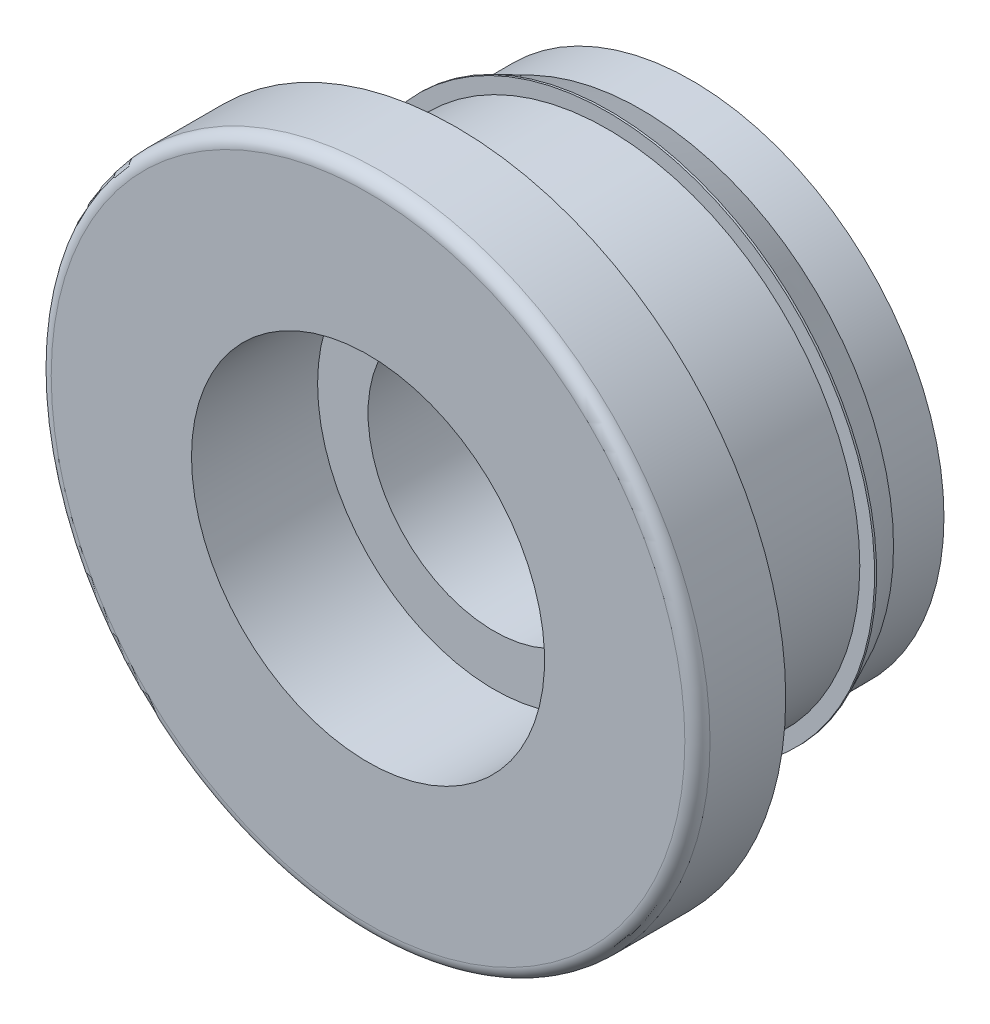
ISO-10303-21;
HEADER;
FILE_DESCRIPTION(('STEP AP214'),'2;1');
FILE_NAME('part.step','',(''),(''),'','','');
FILE_SCHEMA(('AUTOMOTIVE_DESIGN { 1 0 10303 214 1 1 1 1 }'));
ENDSEC;
DATA;
#1=APPLICATION_CONTEXT('core data for automotive mechanical design processes');
#2=APPLICATION_PROTOCOL_DEFINITION('international standard','automotive_design',2000,#1);
#3=PRODUCT_CONTEXT('',#1,'mechanical');
#4=PRODUCT('Part','Part','',(#3));
#5=PRODUCT_RELATED_PRODUCT_CATEGORY('part','',(#4));
#6=PRODUCT_DEFINITION_FORMATION('','',#4);
#7=PRODUCT_DEFINITION_CONTEXT('part definition',#1,'design');
#8=PRODUCT_DEFINITION('design','',#6,#7);
#9=PRODUCT_DEFINITION_SHAPE('','',#8);
#10=(LENGTH_UNIT() NAMED_UNIT(*) SI_UNIT(.MILLI.,.METRE.));
#11=(NAMED_UNIT(*) PLANE_ANGLE_UNIT() SI_UNIT($,.RADIAN.));
#12=(NAMED_UNIT(*) SI_UNIT($,.STERADIAN.) SOLID_ANGLE_UNIT());
#13=UNCERTAINTY_MEASURE_WITH_UNIT(LENGTH_MEASURE(1.E-05),#10,'distance_accuracy_value','');
#14=(GEOMETRIC_REPRESENTATION_CONTEXT(3) GLOBAL_UNCERTAINTY_ASSIGNED_CONTEXT((#13)) GLOBAL_UNIT_ASSIGNED_CONTEXT((#10,
#11,#12)) REPRESENTATION_CONTEXT('',''));
#15=CARTESIAN_POINT('',(0.,0.,0.));
#16=DIRECTION('',(0.,0.,1.));
#17=DIRECTION('',(1.,0.,0.));
#18=AXIS2_PLACEMENT_3D('',#15,#16,#17);
#19=CARTESIAN_POINT('',(0.,0.,4.1));
#20=DIRECTION('',(0.,0.,1.));
#21=DIRECTION('',(1.,0.,0.));
#22=AXIS2_PLACEMENT_3D('',#19,#20,#21);
#23=PLANE('',#22);
#24=CARTESIAN_POINT('',(0.,0.,4.1));
#25=DIRECTION('',(0.,0.,-1.));
#26=DIRECTION('',(-1.,0.,0.));
#27=AXIS2_PLACEMENT_3D('',#24,#25,#26);
#28=CIRCLE('',#27,4.);
#29=CARTESIAN_POINT('',(4.,0.,4.09999999999995));
#30=VERTEX_POINT('',#29);
#31=EDGE_CURVE('E25',#30,#30,#28,.T.);
#32=ORIENTED_EDGE('',*,*,#31,.F.);
#33=EDGE_LOOP('',(#32));
#34=FACE_BOUND('',#33,.T.);
#35=CARTESIAN_POINT('',(0.,0.,4.1));
#36=DIRECTION('',(0.,0.,1.));
#37=DIRECTION('',(1.,0.,0.));
#38=AXIS2_PLACEMENT_3D('',#35,#36,#37);
#39=CIRCLE('',#38,5.225);
#40=CARTESIAN_POINT('',(-5.225,0.,4.10000000000005));
#41=VERTEX_POINT('',#40);
#42=EDGE_CURVE('E130',#41,#41,#39,.T.);
#43=ORIENTED_EDGE('',*,*,#42,.F.);
#44=EDGE_LOOP('',(#43));
#45=FACE_BOUND('',#44,.T.);
#46=ADVANCED_FACE('F16',(#34,#45),#23,.F.);
#47=CARTESIAN_POINT('',(0.,0.,2.1));
#48=DIRECTION('',(0.,0.,-1.));
#49=DIRECTION('',(-1.,0.,0.));
#50=AXIS2_PLACEMENT_3D('',#47,#48,#49);
#51=CYLINDRICAL_SURFACE('',#50,2.);
#52=CARTESIAN_POINT('',(0.,0.,0.365));
#53=DIRECTION('',(0.,0.,1.));
#54=DIRECTION('',(-1.,0.,0.));
#55=AXIS2_PLACEMENT_3D('',#52,#53,#54);
#56=CIRCLE('',#55,2.);
#57=CARTESIAN_POINT('',(2.,0.,0.364999999999983));
#58=VERTEX_POINT('',#57);
#59=EDGE_CURVE('E121',#58,#58,#56,.T.);
#60=ORIENTED_EDGE('',*,*,#59,.F.);
#61=DIRECTION('',(0.,0.,1.));
#62=VECTOR('',#61,1.);
#63=CARTESIAN_POINT('',(2.,0.,2.1));
#64=LINE('',#63,#62);
#65=CARTESIAN_POINT('',(2.00000000000003,0.,3.5));
#66=VERTEX_POINT('',#65);
#67=EDGE_CURVE('E11',#58,#66,#64,.T.);
#68=ORIENTED_EDGE('',*,*,#67,.T.);
#69=CARTESIAN_POINT('',(0.,0.,3.5));
#70=DIRECTION('',(0.,0.,1.));
#71=DIRECTION('',(-1.,0.,0.));
#72=AXIS2_PLACEMENT_3D('',#69,#70,#71);
#73=CIRCLE('',#72,2.);
#74=EDGE_CURVE('E146',#66,#66,#73,.T.);
#75=ORIENTED_EDGE('',*,*,#74,.T.);
#76=ORIENTED_EDGE('',*,*,#67,.F.);
#77=EDGE_LOOP('',(#60,#68,#75,#76));
#78=FACE_BOUND('',#77,.T.);
#79=ADVANCED_FACE('F272',(#78),#51,.F.);
#80=CARTESIAN_POINT('',(0.,0.,4.5));
#81=DIRECTION('',(0.,0.,-1.));
#82=DIRECTION('',(-1.,0.,0.));
#83=AXIS2_PLACEMENT_3D('',#80,#81,#82);
#84=CYLINDRICAL_SURFACE('',#83,4.);
#85=CARTESIAN_POINT('',(0.,0.,1.7));
#86=DIRECTION('',(0.,0.,1.));
#87=DIRECTION('',(-1.,0.,0.));
#88=AXIS2_PLACEMENT_3D('',#85,#86,#87);
#89=CIRCLE('',#88,4.);
#90=CARTESIAN_POINT('',(4.,0.,1.69999999999994));
#91=VERTEX_POINT('',#90);
#92=EDGE_CURVE('E155',#91,#91,#89,.T.);
#93=ORIENTED_EDGE('',*,*,#92,.T.);
#94=DIRECTION('',(0.,0.,1.));
#95=VECTOR('',#94,1.);
#96=CARTESIAN_POINT('',(4.00000000000005,0.,4.49999999999995));
#97=LINE('',#96,#95);
#98=EDGE_CURVE('E145',#91,#30,#97,.T.);
#99=ORIENTED_EDGE('',*,*,#98,.T.);
#100=ORIENTED_EDGE('',*,*,#31,.T.);
#101=ORIENTED_EDGE('',*,*,#98,.F.);
#102=EDGE_LOOP('',(#93,#99,#100,#101));
#103=FACE_BOUND('',#102,.T.);
#104=ADVANCED_FACE('F263',(#103),#84,.T.);
#105=CARTESIAN_POINT('',(0.,0.,5.5));
#106=DIRECTION('',(0.,0.,1.));
#107=DIRECTION('',(1.,0.,0.));
#108=AXIS2_PLACEMENT_3D('',#105,#106,#107);
#109=CYLINDRICAL_SURFACE('',#108,2.8);
#110=CARTESIAN_POINT('',(0.,0.,3.5));
#111=DIRECTION('',(0.,0.,-1.));
#112=DIRECTION('',(1.,0.,0.));
#113=AXIS2_PLACEMENT_3D('',#110,#111,#112);
#114=CIRCLE('',#113,2.8);
#115=CARTESIAN_POINT('',(-2.8,0.,3.5));
#116=VERTEX_POINT('',#115);
#117=EDGE_CURVE('E165',#116,#116,#114,.T.);
#118=ORIENTED_EDGE('',*,*,#117,.T.);
#119=DIRECTION('',(0.,0.,1.));
#120=VECTOR('',#119,1.);
#121=CARTESIAN_POINT('',(-2.79999999999995,0.,5.5));
#122=LINE('',#121,#120);
#123=CARTESIAN_POINT('',(-2.79999999999995,0.,5.5));
#124=VERTEX_POINT('',#123);
#125=EDGE_CURVE('E142',#116,#124,#122,.T.);
#126=ORIENTED_EDGE('',*,*,#125,.T.);
#127=CARTESIAN_POINT('',(0.,0.,5.5));
#128=DIRECTION('',(0.,0.,-1.));
#129=DIRECTION('',(1.,0.,0.));
#130=AXIS2_PLACEMENT_3D('',#127,#128,#129);
#131=CIRCLE('',#130,2.8);
#132=EDGE_CURVE('E152',#124,#124,#131,.T.);
#133=ORIENTED_EDGE('',*,*,#132,.F.);
#134=ORIENTED_EDGE('',*,*,#125,.F.);
#135=EDGE_LOOP('',(#118,#126,#133,#134));
#136=FACE_BOUND('',#135,.T.);
#137=ADVANCED_FACE('F254',(#136),#109,.F.);
#138=CARTESIAN_POINT('',(0.,0.,3.5));
#139=DIRECTION('',(0.,0.,1.));
#140=DIRECTION('',(1.,0.,0.));
#141=AXIS2_PLACEMENT_3D('',#138,#139,#140);
#142=PLANE('',#141);
#143=ORIENTED_EDGE('',*,*,#74,.F.);
#144=EDGE_LOOP('',(#143));
#145=FACE_BOUND('',#144,.T.);
#146=ORIENTED_EDGE('',*,*,#117,.F.);
#147=EDGE_LOOP('',(#146));
#148=FACE_BOUND('',#147,.T.);
#149=ADVANCED_FACE('F238',(#145,#148),#142,.T.);
#150=CARTESIAN_POINT('',(0.,0.,1.7));
#151=DIRECTION('',(0.,0.,1.));
#152=DIRECTION('',(1.,0.,0.));
#153=AXIS2_PLACEMENT_3D('',#150,#151,#152);
#154=PLANE('',#153);
#155=ORIENTED_EDGE('',*,*,#92,.F.);
#156=EDGE_LOOP('',(#155));
#157=FACE_BOUND('',#156,.T.);
#158=CARTESIAN_POINT('',(0.,0.,1.7));
#159=DIRECTION('',(0.,0.,1.));
#160=DIRECTION('',(1.,0.,0.));
#161=AXIS2_PLACEMENT_3D('',#158,#159,#160);
#162=CIRCLE('',#161,4.235);
#163=CARTESIAN_POINT('',(-4.235,0.,1.7));
#164=VERTEX_POINT('',#163);
#165=EDGE_CURVE('E84',#164,#164,#162,.T.);
#166=ORIENTED_EDGE('',*,*,#165,.T.);
#167=EDGE_LOOP('',(#166));
#168=FACE_BOUND('',#167,.T.);
#169=ADVANCED_FACE('F234',(#157,#168),#154,.T.);
#170=CARTESIAN_POINT('',(0.,0.,1.7));
#171=DIRECTION('',(0.,0.,-1.));
#172=DIRECTION('',(1.,0.,0.));
#173=AXIS2_PLACEMENT_3D('',#170,#171,#172);
#174=CYLINDRICAL_SURFACE('',#173,4.235);
#175=CARTESIAN_POINT('',(0.,0.,1.66895923819715));
#176=DIRECTION('',(0.,0.,-1.));
#177=DIRECTION('',(1.,0.,0.));
#178=AXIS2_PLACEMENT_3D('',#175,#176,#177);
#179=CIRCLE('',#178,4.235);
#180=CARTESIAN_POINT('',(-4.235,0.,1.66895923819715));
#181=VERTEX_POINT('',#180);
#182=EDGE_CURVE('E120',#181,#181,#179,.T.);
#183=ORIENTED_EDGE('',*,*,#182,.F.);
#184=DIRECTION('',(0.,0.,1.));
#185=VECTOR('',#184,1.);
#186=CARTESIAN_POINT('',(-4.235,0.,1.7));
#187=LINE('',#186,#185);
#188=EDGE_CURVE('E75',#181,#164,#187,.T.);
#189=ORIENTED_EDGE('',*,*,#188,.T.);
#190=ORIENTED_EDGE('',*,*,#165,.F.);
#191=ORIENTED_EDGE('',*,*,#188,.F.);
#192=EDGE_LOOP('',(#183,#189,#190,#191));
#193=FACE_BOUND('',#192,.T.);
#194=ADVANCED_FACE('F186',(#193),#174,.T.);
#195=CARTESIAN_POINT('',(0.,0.,1.16499990224838));
#196=DIRECTION('',(0.,0.,1.));
#197=DIRECTION('',(1.,0.,0.));
#198=AXIS2_PLACEMENT_3D('',#195,#196,#197);
#199=CONICAL_SURFACE('',#198,3.99999990224838,0.436332312998583);
#200=CARTESIAN_POINT('',(0.,0.,1.165));
#201=DIRECTION('',(0.,0.,1.));
#202=DIRECTION('',(-1.,0.,0.));
#203=AXIS2_PLACEMENT_3D('',#200,#201,#202);
#204=CIRCLE('',#203,4.);
#205=CARTESIAN_POINT('',(4.,0.,1.16499999999996));
#206=VERTEX_POINT('',#205);
#207=CARTESIAN_POINT('',(-3.99999995714845,0.,1.16500001998196));
#208=VERTEX_POINT('',#207);
#209=EDGE_CURVE('E94',#206,#208,#204,.T.);
#210=ORIENTED_EDGE('',*,*,#209,.T.);
#211=DIRECTION('',(-0.4226182617407,0.,0.90630778703665));
#212=VECTOR('',#211,1.);
#213=CARTESIAN_POINT('',(-3.99999990224838,0.,1.16499990224838));
#214=LINE('',#213,#212);
#215=EDGE_CURVE('E149',#208,#181,#214,.T.);
#216=ORIENTED_EDGE('',*,*,#215,.T.);
#217=ORIENTED_EDGE('',*,*,#182,.T.);
#218=ORIENTED_EDGE('',*,*,#215,.F.);
#219=CARTESIAN_POINT('',(0.,0.,1.165));
#220=DIRECTION('',(0.,0.,1.));
#221=DIRECTION('',(-1.,0.,0.));
#222=AXIS2_PLACEMENT_3D('',#219,#220,#221);
#223=CIRCLE('',#222,4.);
#224=EDGE_CURVE('E106',#208,#206,#223,.T.);
#225=ORIENTED_EDGE('',*,*,#224,.T.);
#226=EDGE_LOOP('',(#210,#216,#217,#218,#225));
#227=FACE_BOUND('',#226,.T.);
#228=ADVANCED_FACE('F180',(#227),#199,.T.);
#229=CARTESIAN_POINT('',(0.,0.,5.5));
#230=DIRECTION('',(0.,0.,1.));
#231=DIRECTION('',(1.,0.,0.));
#232=AXIS2_PLACEMENT_3D('',#229,#230,#231);
#233=PLANE('',#232);
#234=ORIENTED_EDGE('',*,*,#132,.T.);
#235=EDGE_LOOP('',(#234));
#236=FACE_BOUND('',#235,.T.);
#237=CARTESIAN_POINT('',(0.,0.,5.5));
#238=DIRECTION('',(0.,0.,-1.));
#239=DIRECTION('',(1.,0.,0.));
#240=AXIS2_PLACEMENT_3D('',#237,#238,#239);
#241=CIRCLE('',#240,5.025);
#242=CARTESIAN_POINT('',(-5.025,0.,5.5));
#243=VERTEX_POINT('',#242);
#244=EDGE_CURVE('E125',#243,#243,#241,.T.);
#245=ORIENTED_EDGE('',*,*,#244,.F.);
#246=EDGE_LOOP('',(#245));
#247=FACE_BOUND('',#246,.T.);
#248=ADVANCED_FACE('F185',(#236,#247),#233,.T.);
#249=CARTESIAN_POINT('',(0.,0.,4.5));
#250=DIRECTION('',(0.,0.,1.));
#251=DIRECTION('',(1.,0.,0.));
#252=AXIS2_PLACEMENT_3D('',#249,#250,#251);
#253=CYLINDRICAL_SURFACE('',#252,5.225);
#254=CARTESIAN_POINT('',(0.,0.,5.3));
#255=DIRECTION('',(0.,0.,1.));
#256=DIRECTION('',(1.,0.,0.));
#257=AXIS2_PLACEMENT_3D('',#254,#255,#256);
#258=CIRCLE('',#257,5.225);
#259=CARTESIAN_POINT('',(-5.225,0.,5.30000000000006));
#260=VERTEX_POINT('',#259);
#261=EDGE_CURVE('E131',#260,#260,#258,.T.);
#262=ORIENTED_EDGE('',*,*,#261,.F.);
#263=DIRECTION('',(0.,0.,-1.));
#264=VECTOR('',#263,1.);
#265=CARTESIAN_POINT('',(-5.225,0.,4.5));
#266=LINE('',#265,#264);
#267=EDGE_CURVE('E126',#260,#41,#266,.T.);
#268=ORIENTED_EDGE('',*,*,#267,.T.);
#269=ORIENTED_EDGE('',*,*,#42,.T.);
#270=ORIENTED_EDGE('',*,*,#267,.F.);
#271=EDGE_LOOP('',(#262,#268,#269,#270));
#272=FACE_BOUND('',#271,.T.);
#273=ADVANCED_FACE('F212',(#272),#253,.T.);
#274=CARTESIAN_POINT('',(0.,0.,5.3));
#275=DIRECTION('',(0.,0.,1.));
#276=DIRECTION('',(1.,0.,0.));
#277=AXIS2_PLACEMENT_3D('',#274,#275,#276);
#278=TOROIDAL_SURFACE('',#277,5.025,0.2);
#279=ORIENTED_EDGE('',*,*,#244,.T.);
#280=CARTESIAN_POINT('',(-5.025,0.,5.30000000000006));
#281=DIRECTION('',(0.,-1.,0.));
#282=DIRECTION('',(-1.,0.,0.));
#283=AXIS2_PLACEMENT_3D('',#280,#281,#282);
#284=CIRCLE('',#283,0.2);
#285=EDGE_CURVE('E135',#243,#260,#284,.T.);
#286=ORIENTED_EDGE('',*,*,#285,.T.);
#287=ORIENTED_EDGE('',*,*,#261,.T.);
#288=ORIENTED_EDGE('',*,*,#285,.F.);
#289=EDGE_LOOP('',(#279,#286,#287,#288));
#290=FACE_BOUND('',#289,.T.);
#291=ADVANCED_FACE('F203',(#290),#278,.T.);
#292=CARTESIAN_POINT('',(0.,0.,0.365));
#293=DIRECTION('',(0.,0.,-1.));
#294=DIRECTION('',(-1.,0.,0.));
#295=AXIS2_PLACEMENT_3D('',#292,#293,#294);
#296=PLANE('',#295);
#297=ORIENTED_EDGE('',*,*,#59,.T.);
#298=EDGE_LOOP('',(#297));
#299=FACE_BOUND('',#298,.T.);
#300=CARTESIAN_POINT('',(0.,0.,0.365));
#301=DIRECTION('',(0.,0.,-1.));
#302=DIRECTION('',(-1.,0.,0.));
#303=AXIS2_PLACEMENT_3D('',#300,#301,#302);
#304=CIRCLE('',#303,4.);
#305=CARTESIAN_POINT('',(4.,0.,0.364999999999957));
#306=VERTEX_POINT('',#305);
#307=EDGE_CURVE('E104',#306,#306,#304,.T.);
#308=ORIENTED_EDGE('',*,*,#307,.T.);
#309=EDGE_LOOP('',(#308));
#310=FACE_BOUND('',#309,.T.);
#311=ADVANCED_FACE('F109',(#299,#310),#296,.T.);
#312=CARTESIAN_POINT('',(0.,0.,1.165));
#313=DIRECTION('',(0.,0.,-1.));
#314=DIRECTION('',(-1.,0.,0.));
#315=AXIS2_PLACEMENT_3D('',#312,#313,#314);
#316=CYLINDRICAL_SURFACE('',#315,4.);
#317=ORIENTED_EDGE('',*,*,#307,.F.);
#318=DIRECTION('',(0.,0.,1.));
#319=VECTOR('',#318,1.);
#320=CARTESIAN_POINT('',(4.,0.,1.16499999999995));
#321=LINE('',#320,#319);
#322=EDGE_CURVE('E101',#306,#206,#321,.T.);
#323=ORIENTED_EDGE('',*,*,#322,.T.);
#324=ORIENTED_EDGE('',*,*,#224,.F.);
#325=ORIENTED_EDGE('',*,*,#209,.F.);
#326=ORIENTED_EDGE('',*,*,#322,.F.);
#327=EDGE_LOOP('',(#317,#323,#324,#325,#326));
#328=FACE_BOUND('',#327,.T.);
#329=ADVANCED_FACE('F103',(#328),#316,.T.);
#330=CLOSED_SHELL('',(#46,#79,#104,#137,#149,#169,#194,#228,#248,#273,#291,#311,#329));
#331=MANIFOLD_SOLID_BREP('B1',#330);
#332=ADVANCED_BREP_SHAPE_REPRESENTATION('',(#18,#331),#14);
#333=SHAPE_DEFINITION_REPRESENTATION(#9,#332);
ENDSEC;
END-ISO-10303-21;
